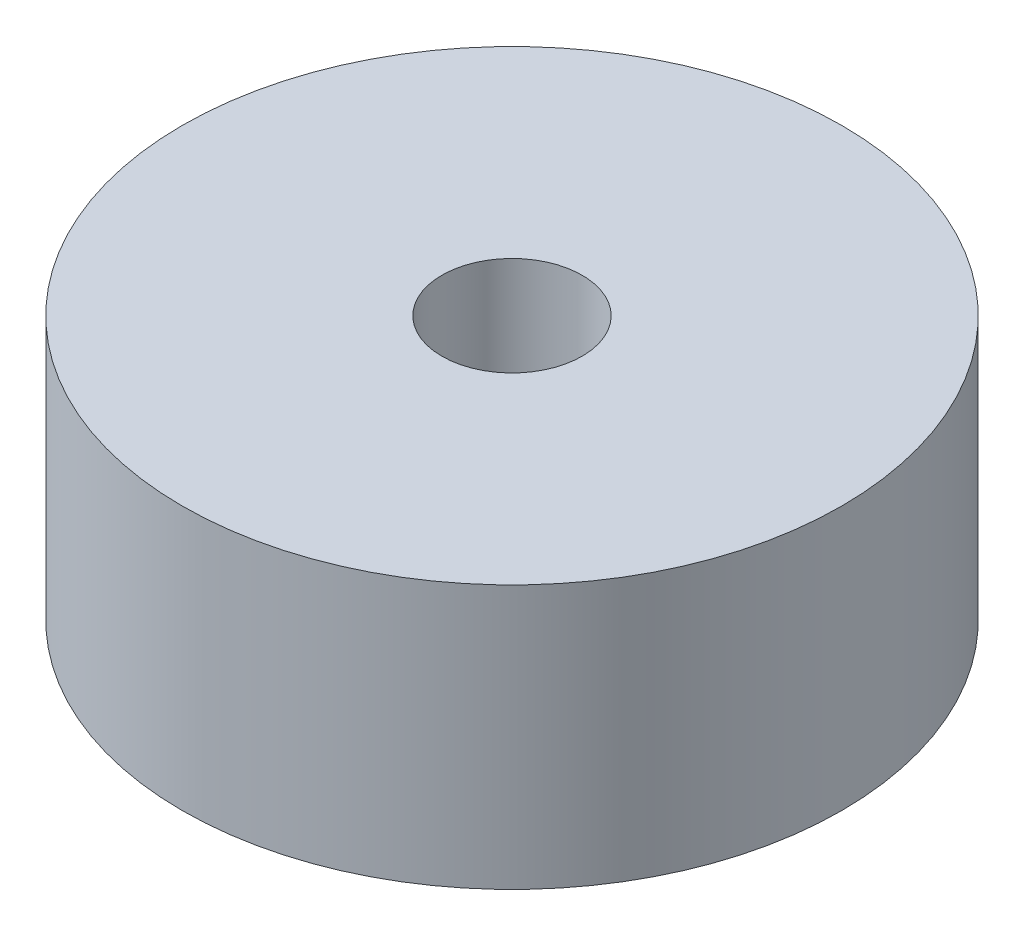
ISO-10303-21;
HEADER;
FILE_DESCRIPTION(('STEP AP214'),'2;1');
FILE_NAME('part.step','',(''),(''),'','','');
FILE_SCHEMA(('AUTOMOTIVE_DESIGN { 1 0 10303 214 1 1 1 1 }'));
ENDSEC;
DATA;
#1=APPLICATION_CONTEXT('core data for automotive mechanical design processes');
#2=APPLICATION_PROTOCOL_DEFINITION('international standard','automotive_design',2000,#1);
#3=PRODUCT_CONTEXT('',#1,'mechanical');
#4=PRODUCT('Part','Part','',(#3));
#5=PRODUCT_RELATED_PRODUCT_CATEGORY('part','',(#4));
#6=PRODUCT_DEFINITION_FORMATION('','',#4);
#7=PRODUCT_DEFINITION_CONTEXT('part definition',#1,'design');
#8=PRODUCT_DEFINITION('design','',#6,#7);
#9=PRODUCT_DEFINITION_SHAPE('','',#8);
#10=(LENGTH_UNIT() NAMED_UNIT(*) SI_UNIT(.MILLI.,.METRE.));
#11=(NAMED_UNIT(*) PLANE_ANGLE_UNIT() SI_UNIT($,.RADIAN.));
#12=(NAMED_UNIT(*) SI_UNIT($,.STERADIAN.) SOLID_ANGLE_UNIT());
#13=UNCERTAINTY_MEASURE_WITH_UNIT(LENGTH_MEASURE(1.E-05),#10,'distance_accuracy_value','');
#14=(GEOMETRIC_REPRESENTATION_CONTEXT(3) GLOBAL_UNCERTAINTY_ASSIGNED_CONTEXT((#13)) GLOBAL_UNIT_ASSIGNED_CONTEXT((#10,
#11,#12)) REPRESENTATION_CONTEXT('',''));
#15=CARTESIAN_POINT('',(0.,0.,0.));
#16=DIRECTION('',(0.,0.,1.));
#17=DIRECTION('',(1.,0.,0.));
#18=AXIS2_PLACEMENT_3D('',#15,#16,#17);
#19=CARTESIAN_POINT('',(0.,6.35,0.));
#20=DIRECTION('',(0.,1.,0.));
#21=DIRECTION('',(0.,0.,1.));
#22=AXIS2_PLACEMENT_3D('',#19,#20,#21);
#23=PLANE('',#22);
#24=CARTESIAN_POINT('',(0.,6.35,0.));
#25=DIRECTION('',(0.,1.,0.));
#26=DIRECTION('',(0.,0.,1.));
#27=AXIS2_PLACEMENT_3D('',#24,#25,#26);
#28=CIRCLE('',#27,7.9375);
#29=CARTESIAN_POINT('',(0.,6.35,7.9375));
#30=VERTEX_POINT('',#29);
#31=EDGE_CURVE('E10',#30,#30,#28,.T.);
#32=ORIENTED_EDGE('',*,*,#31,.T.);
#33=EDGE_LOOP('',(#32));
#34=FACE_BOUND('',#33,.T.);
#35=CARTESIAN_POINT('',(0.,6.35,0.));
#36=DIRECTION('',(0.,1.,0.));
#37=DIRECTION('',(0.,0.,1.));
#38=AXIS2_PLACEMENT_3D('',#35,#36,#37);
#39=CIRCLE('',#38,1.6891);
#40=CARTESIAN_POINT('',(0.,6.35,1.6891));
#41=VERTEX_POINT('',#40);
#42=EDGE_CURVE('E50',#41,#41,#39,.T.);
#43=ORIENTED_EDGE('',*,*,#42,.F.);
#44=EDGE_LOOP('',(#43));
#45=FACE_BOUND('',#44,.T.);
#46=ADVANCED_FACE('F37',(#34,#45),#23,.T.);
#47=CARTESIAN_POINT('',(0.,0.,0.));
#48=DIRECTION('',(0.,1.,0.));
#49=DIRECTION('',(0.,0.,1.));
#50=AXIS2_PLACEMENT_3D('',#47,#48,#49);
#51=PLANE('',#50);
#52=CARTESIAN_POINT('',(0.,0.,0.));
#53=DIRECTION('',(0.,1.,0.));
#54=DIRECTION('',(0.,0.,1.));
#55=AXIS2_PLACEMENT_3D('',#52,#53,#54);
#56=CIRCLE('',#55,7.9375);
#57=CARTESIAN_POINT('',(0.,0.,7.9375));
#58=VERTEX_POINT('',#57);
#59=EDGE_CURVE('E41',#58,#58,#56,.T.);
#60=ORIENTED_EDGE('',*,*,#59,.F.);
#61=EDGE_LOOP('',(#60));
#62=FACE_BOUND('',#61,.T.);
#63=CARTESIAN_POINT('',(0.,0.,0.));
#64=DIRECTION('',(0.,1.,0.));
#65=DIRECTION('',(0.,0.,1.));
#66=AXIS2_PLACEMENT_3D('',#63,#64,#65);
#67=CIRCLE('',#66,1.6891);
#68=CARTESIAN_POINT('',(0.,0.,1.6891));
#69=VERTEX_POINT('',#68);
#70=EDGE_CURVE('E52',#69,#69,#67,.T.);
#71=ORIENTED_EDGE('',*,*,#70,.T.);
#72=EDGE_LOOP('',(#71));
#73=FACE_BOUND('',#72,.T.);
#74=ADVANCED_FACE('F64',(#62,#73),#51,.F.);
#75=CARTESIAN_POINT('',(0.,6.35,0.));
#76=DIRECTION('',(0.,-1.,0.));
#77=DIRECTION('',(0.,0.,-1.));
#78=AXIS2_PLACEMENT_3D('',#75,#76,#77);
#79=CYLINDRICAL_SURFACE('',#78,7.9375);
#80=ORIENTED_EDGE('',*,*,#31,.F.);
#81=EDGE_LOOP('',(#80));
#82=FACE_BOUND('',#81,.T.);
#83=ORIENTED_EDGE('',*,*,#59,.T.);
#84=EDGE_LOOP('',(#83));
#85=FACE_BOUND('',#84,.T.);
#86=ADVANCED_FACE('F39',(#82,#85),#79,.T.);
#87=CARTESIAN_POINT('',(0.,6.35,0.));
#88=DIRECTION('',(0.,-1.,0.));
#89=DIRECTION('',(0.,0.,-1.));
#90=AXIS2_PLACEMENT_3D('',#87,#88,#89);
#91=CYLINDRICAL_SURFACE('',#90,1.6891);
#92=ORIENTED_EDGE('',*,*,#42,.T.);
#93=EDGE_LOOP('',(#92));
#94=FACE_BOUND('',#93,.T.);
#95=ORIENTED_EDGE('',*,*,#70,.F.);
#96=EDGE_LOOP('',(#95));
#97=FACE_BOUND('',#96,.T.);
#98=ADVANCED_FACE('F60',(#94,#97),#91,.F.);
#99=CLOSED_SHELL('',(#46,#74,#86,#98));
#100=MANIFOLD_SOLID_BREP('B2',#99);
#101=ADVANCED_BREP_SHAPE_REPRESENTATION('',(#18,#100),#14);
#102=SHAPE_DEFINITION_REPRESENTATION(#9,#101);
ENDSEC;
END-ISO-10303-21;
